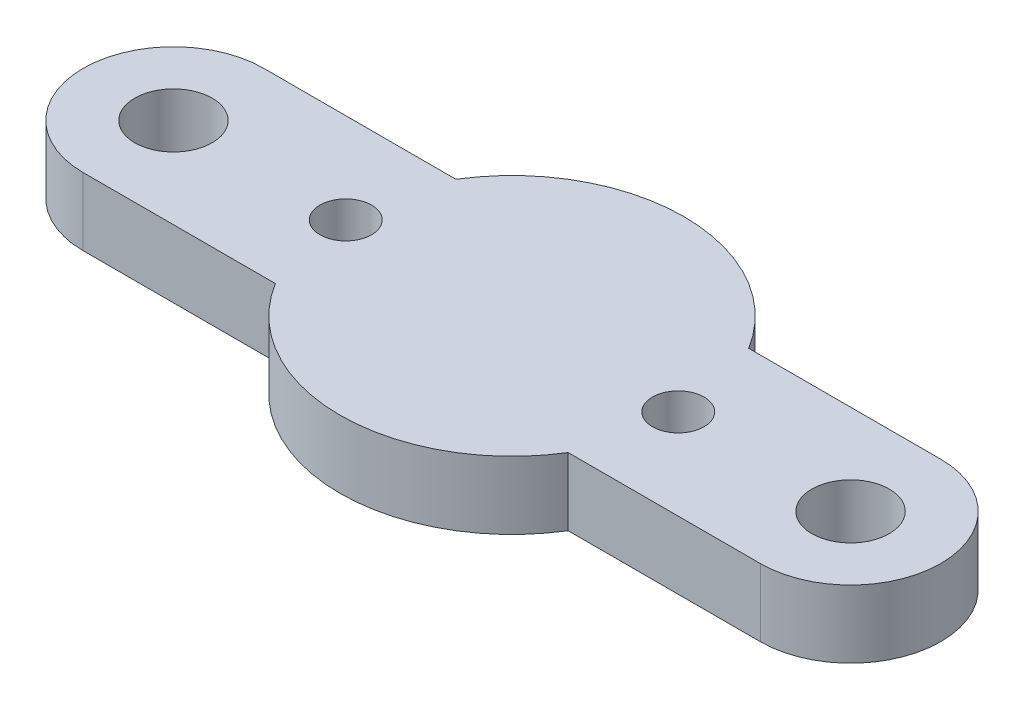
ISO-10303-21;
HEADER;
FILE_DESCRIPTION(('STEP AP214'),'2;1');
FILE_NAME('part.step','',(''),(''),'','','');
FILE_SCHEMA(('AUTOMOTIVE_DESIGN { 1 0 10303 214 1 1 1 1 }'));
ENDSEC;
DATA;
#1=APPLICATION_CONTEXT('core data for automotive mechanical design processes');
#2=APPLICATION_PROTOCOL_DEFINITION('international standard','automotive_design',2000,#1);
#3=PRODUCT_CONTEXT('',#1,'mechanical');
#4=PRODUCT('Part','Part','',(#3));
#5=PRODUCT_RELATED_PRODUCT_CATEGORY('part','',(#4));
#6=PRODUCT_DEFINITION_FORMATION('','',#4);
#7=PRODUCT_DEFINITION_CONTEXT('part definition',#1,'design');
#8=PRODUCT_DEFINITION('design','',#6,#7);
#9=PRODUCT_DEFINITION_SHAPE('','',#8);
#10=(LENGTH_UNIT() NAMED_UNIT(*) SI_UNIT(.MILLI.,.METRE.));
#11=(NAMED_UNIT(*) PLANE_ANGLE_UNIT() SI_UNIT($,.RADIAN.));
#12=(NAMED_UNIT(*) SI_UNIT($,.STERADIAN.) SOLID_ANGLE_UNIT());
#13=UNCERTAINTY_MEASURE_WITH_UNIT(LENGTH_MEASURE(1.E-05),#10,'distance_accuracy_value','');
#14=(GEOMETRIC_REPRESENTATION_CONTEXT(3) GLOBAL_UNCERTAINTY_ASSIGNED_CONTEXT((#13)) GLOBAL_UNIT_ASSIGNED_CONTEXT((#10,
#11,#12)) REPRESENTATION_CONTEXT('',''));
#15=CARTESIAN_POINT('',(0.,0.,0.));
#16=DIRECTION('',(0.,0.,1.));
#17=DIRECTION('',(1.,0.,0.));
#18=AXIS2_PLACEMENT_3D('',#15,#16,#17);
#19=CARTESIAN_POINT('',(-15.,3.,0.));
#20=DIRECTION('',(0.,1.,0.));
#21=DIRECTION('',(0.,0.,1.));
#22=AXIS2_PLACEMENT_3D('',#19,#20,#21);
#23=PLANE('',#22);
#24=CARTESIAN_POINT('',(-15.,3.,0.));
#25=DIRECTION('',(0.,1.,0.));
#26=DIRECTION('',(0.,0.,1.));
#27=AXIS2_PLACEMENT_3D('',#24,#25,#26);
#28=CIRCLE('',#27,1.7145);
#29=CARTESIAN_POINT('',(-15.,3.,1.7145));
#30=VERTEX_POINT('',#29);
#31=EDGE_CURVE('E190',#30,#30,#28,.T.);
#32=ORIENTED_EDGE('',*,*,#31,.F.);
#33=EDGE_LOOP('',(#32));
#34=FACE_BOUND('',#33,.T.);
#35=CARTESIAN_POINT('',(-7.366,3.,0.));
#36=DIRECTION('',(0.,1.,0.));
#37=DIRECTION('',(0.,0.,1.));
#38=AXIS2_PLACEMENT_3D('',#35,#36,#37);
#39=CIRCLE('',#38,1.143);
#40=CARTESIAN_POINT('',(-7.366,3.,1.143));
#41=VERTEX_POINT('',#40);
#42=EDGE_CURVE('E136',#41,#41,#39,.T.);
#43=ORIENTED_EDGE('',*,*,#42,.F.);
#44=EDGE_LOOP('',(#43));
#45=FACE_BOUND('',#44,.T.);
#46=CARTESIAN_POINT('',(-15.,3.,0.));
#47=DIRECTION('',(0.,1.,0.));
#48=DIRECTION('',(0.,0.,1.));
#49=AXIS2_PLACEMENT_3D('',#46,#47,#48);
#50=CIRCLE('',#49,3.99999999999999);
#51=CARTESIAN_POINT('',(-15.,3.,-3.99999999999999));
#52=VERTEX_POINT('',#51);
#53=CARTESIAN_POINT('',(-15.,3.,4.));
#54=VERTEX_POINT('',#53);
#55=EDGE_CURVE('E147',#52,#54,#50,.T.);
#56=ORIENTED_EDGE('',*,*,#55,.T.);
#57=DIRECTION('',(1.,0.,0.));
#58=VECTOR('',#57,1.);
#59=CARTESIAN_POINT('',(-15.,3.,4.));
#60=LINE('',#59,#58);
#61=CARTESIAN_POINT('',(-6.48570736311776,3.,4.));
#62=VERTEX_POINT('',#61);
#63=EDGE_CURVE('E95',#54,#62,#60,.T.);
#64=ORIENTED_EDGE('',*,*,#63,.T.);
#65=CARTESIAN_POINT('',(0.,3.,0.));
#66=DIRECTION('',(0.,1.,0.));
#67=DIRECTION('',(0.,0.,1.));
#68=AXIS2_PLACEMENT_3D('',#65,#66,#67);
#69=CIRCLE('',#68,7.62);
#70=CARTESIAN_POINT('',(6.48570736311776,3.,4.));
#71=VERTEX_POINT('',#70);
#72=EDGE_CURVE('E162',#62,#71,#69,.T.);
#73=ORIENTED_EDGE('',*,*,#72,.T.);
#74=DIRECTION('',(1.,0.,0.));
#75=VECTOR('',#74,1.);
#76=CARTESIAN_POINT('',(6.48570736311776,3.,4.));
#77=LINE('',#76,#75);
#78=CARTESIAN_POINT('',(15.,3.,3.99999999999999));
#79=VERTEX_POINT('',#78);
#80=EDGE_CURVE('E175',#71,#79,#77,.T.);
#81=ORIENTED_EDGE('',*,*,#80,.T.);
#82=CARTESIAN_POINT('',(15.,3.,0.));
#83=DIRECTION('',(0.,1.,0.));
#84=DIRECTION('',(0.,0.,1.));
#85=AXIS2_PLACEMENT_3D('',#82,#83,#84);
#86=CIRCLE('',#85,3.99999999999999);
#87=CARTESIAN_POINT('',(15.,3.,-3.99999999999999));
#88=VERTEX_POINT('',#87);
#89=EDGE_CURVE('E114',#79,#88,#86,.T.);
#90=ORIENTED_EDGE('',*,*,#89,.T.);
#91=DIRECTION('',(-1.,0.,0.));
#92=VECTOR('',#91,1.);
#93=CARTESIAN_POINT('',(6.48570736311776,3.,-4.));
#94=LINE('',#93,#92);
#95=CARTESIAN_POINT('',(6.48570736311776,3.,-4.));
#96=VERTEX_POINT('',#95);
#97=EDGE_CURVE('E108',#88,#96,#94,.T.);
#98=ORIENTED_EDGE('',*,*,#97,.T.);
#99=CARTESIAN_POINT('',(0.,3.,0.));
#100=DIRECTION('',(0.,1.,0.));
#101=DIRECTION('',(0.,0.,1.));
#102=AXIS2_PLACEMENT_3D('',#99,#100,#101);
#103=CIRCLE('',#102,7.62);
#104=CARTESIAN_POINT('',(-6.48570736311776,3.,-4.));
#105=VERTEX_POINT('',#104);
#106=EDGE_CURVE('E112',#96,#105,#103,.T.);
#107=ORIENTED_EDGE('',*,*,#106,.T.);
#108=DIRECTION('',(-1.,0.,0.));
#109=VECTOR('',#108,1.);
#110=CARTESIAN_POINT('',(-15.,3.,-3.99999999999999));
#111=LINE('',#110,#109);
#112=EDGE_CURVE('E52',#105,#52,#111,.T.);
#113=ORIENTED_EDGE('',*,*,#112,.T.);
#114=EDGE_LOOP('',(#56,#64,#73,#81,#90,#98,#107,#113));
#115=FACE_BOUND('',#114,.T.);
#116=CARTESIAN_POINT('',(7.366,3.,0.));
#117=DIRECTION('',(0.,1.,0.));
#118=DIRECTION('',(0.,0.,1.));
#119=AXIS2_PLACEMENT_3D('',#116,#117,#118);
#120=CIRCLE('',#119,1.143);
#121=CARTESIAN_POINT('',(7.366,3.,1.143));
#122=VERTEX_POINT('',#121);
#123=EDGE_CURVE('E184',#122,#122,#120,.T.);
#124=ORIENTED_EDGE('',*,*,#123,.F.);
#125=EDGE_LOOP('',(#124));
#126=FACE_BOUND('',#125,.T.);
#127=CARTESIAN_POINT('',(15.,3.,0.));
#128=DIRECTION('',(0.,1.,0.));
#129=DIRECTION('',(0.,0.,1.));
#130=AXIS2_PLACEMENT_3D('',#127,#128,#129);
#131=CIRCLE('',#130,1.7145);
#132=CARTESIAN_POINT('',(15.,3.,1.71449999999999));
#133=VERTEX_POINT('',#132);
#134=EDGE_CURVE('E196',#133,#133,#131,.T.);
#135=ORIENTED_EDGE('',*,*,#134,.F.);
#136=EDGE_LOOP('',(#135));
#137=FACE_BOUND('',#136,.T.);
#138=ADVANCED_FACE('F35',(#34,#45,#115,#126,#137),#23,.T.);
#139=CARTESIAN_POINT('',(-15.,0.,0.));
#140=DIRECTION('',(0.,1.,0.));
#141=DIRECTION('',(0.,0.,1.));
#142=AXIS2_PLACEMENT_3D('',#139,#140,#141);
#143=PLANE('',#142);
#144=CARTESIAN_POINT('',(-15.,0.,0.));
#145=DIRECTION('',(0.,1.,0.));
#146=DIRECTION('',(0.,0.,1.));
#147=AXIS2_PLACEMENT_3D('',#144,#145,#146);
#148=CIRCLE('',#147,1.7145);
#149=CARTESIAN_POINT('',(-15.,0.,1.7145));
#150=VERTEX_POINT('',#149);
#151=EDGE_CURVE('E193',#150,#150,#148,.T.);
#152=ORIENTED_EDGE('',*,*,#151,.T.);
#153=EDGE_LOOP('',(#152));
#154=FACE_BOUND('',#153,.T.);
#155=CARTESIAN_POINT('',(-7.366,0.,0.));
#156=DIRECTION('',(0.,1.,0.));
#157=DIRECTION('',(0.,0.,1.));
#158=AXIS2_PLACEMENT_3D('',#155,#156,#157);
#159=CIRCLE('',#158,1.143);
#160=CARTESIAN_POINT('',(-7.366,0.,1.143));
#161=VERTEX_POINT('',#160);
#162=EDGE_CURVE('E181',#161,#161,#159,.T.);
#163=ORIENTED_EDGE('',*,*,#162,.T.);
#164=EDGE_LOOP('',(#163));
#165=FACE_BOUND('',#164,.T.);
#166=CARTESIAN_POINT('',(-15.,0.,0.));
#167=DIRECTION('',(0.,1.,0.));
#168=DIRECTION('',(0.,0.,1.));
#169=AXIS2_PLACEMENT_3D('',#166,#167,#168);
#170=CIRCLE('',#169,3.99999999999999);
#171=CARTESIAN_POINT('',(-15.,0.,-3.99999999999999));
#172=VERTEX_POINT('',#171);
#173=CARTESIAN_POINT('',(-15.,0.,4.));
#174=VERTEX_POINT('',#173);
#175=EDGE_CURVE('E132',#172,#174,#170,.T.);
#176=ORIENTED_EDGE('',*,*,#175,.F.);
#177=DIRECTION('',(-1.,0.,0.));
#178=VECTOR('',#177,1.);
#179=CARTESIAN_POINT('',(-15.,0.,-3.99999999999999));
#180=LINE('',#179,#178);
#181=CARTESIAN_POINT('',(-6.48570736311776,0.,-4.));
#182=VERTEX_POINT('',#181);
#183=EDGE_CURVE('E87',#182,#172,#180,.T.);
#184=ORIENTED_EDGE('',*,*,#183,.F.);
#185=CARTESIAN_POINT('',(0.,0.,0.));
#186=DIRECTION('',(0.,1.,0.));
#187=DIRECTION('',(0.,0.,1.));
#188=AXIS2_PLACEMENT_3D('',#185,#186,#187);
#189=CIRCLE('',#188,7.62);
#190=CARTESIAN_POINT('',(6.48570736311776,0.,-4.));
#191=VERTEX_POINT('',#190);
#192=EDGE_CURVE('E81',#191,#182,#189,.T.);
#193=ORIENTED_EDGE('',*,*,#192,.F.);
#194=DIRECTION('',(-1.,0.,0.));
#195=VECTOR('',#194,1.);
#196=CARTESIAN_POINT('',(6.48570736311776,0.,-4.));
#197=LINE('',#196,#195);
#198=CARTESIAN_POINT('',(15.,0.,-3.99999999999999));
#199=VERTEX_POINT('',#198);
#200=EDGE_CURVE('E122',#199,#191,#197,.T.);
#201=ORIENTED_EDGE('',*,*,#200,.F.);
#202=CARTESIAN_POINT('',(15.,0.,0.));
#203=DIRECTION('',(0.,1.,0.));
#204=DIRECTION('',(0.,0.,1.));
#205=AXIS2_PLACEMENT_3D('',#202,#203,#204);
#206=CIRCLE('',#205,3.99999999999999);
#207=CARTESIAN_POINT('',(15.,0.,3.99999999999999));
#208=VERTEX_POINT('',#207);
#209=EDGE_CURVE('E142',#208,#199,#206,.T.);
#210=ORIENTED_EDGE('',*,*,#209,.F.);
#211=DIRECTION('',(1.,0.,0.));
#212=VECTOR('',#211,1.);
#213=CARTESIAN_POINT('',(6.48570736311776,0.,4.));
#214=LINE('',#213,#212);
#215=CARTESIAN_POINT('',(6.48570736311776,0.,4.));
#216=VERTEX_POINT('',#215);
#217=EDGE_CURVE('E140',#216,#208,#214,.T.);
#218=ORIENTED_EDGE('',*,*,#217,.F.);
#219=CARTESIAN_POINT('',(0.,0.,0.));
#220=DIRECTION('',(0.,1.,0.));
#221=DIRECTION('',(0.,0.,1.));
#222=AXIS2_PLACEMENT_3D('',#219,#220,#221);
#223=CIRCLE('',#222,7.62);
#224=CARTESIAN_POINT('',(-6.48570736311776,0.,4.));
#225=VERTEX_POINT('',#224);
#226=EDGE_CURVE('E138',#225,#216,#223,.T.);
#227=ORIENTED_EDGE('',*,*,#226,.F.);
#228=DIRECTION('',(1.,0.,0.));
#229=VECTOR('',#228,1.);
#230=CARTESIAN_POINT('',(-15.,0.,4.));
#231=LINE('',#230,#229);
#232=EDGE_CURVE('E135',#174,#225,#231,.T.);
#233=ORIENTED_EDGE('',*,*,#232,.F.);
#234=EDGE_LOOP('',(#176,#184,#193,#201,#210,#218,#227,#233));
#235=FACE_BOUND('',#234,.T.);
#236=CARTESIAN_POINT('',(7.366,0.,0.));
#237=DIRECTION('',(0.,1.,0.));
#238=DIRECTION('',(0.,0.,1.));
#239=AXIS2_PLACEMENT_3D('',#236,#237,#238);
#240=CIRCLE('',#239,1.143);
#241=CARTESIAN_POINT('',(7.366,0.,1.143));
#242=VERTEX_POINT('',#241);
#243=EDGE_CURVE('E187',#242,#242,#240,.T.);
#244=ORIENTED_EDGE('',*,*,#243,.T.);
#245=EDGE_LOOP('',(#244));
#246=FACE_BOUND('',#245,.T.);
#247=CARTESIAN_POINT('',(15.,0.,0.));
#248=DIRECTION('',(0.,1.,0.));
#249=DIRECTION('',(0.,0.,1.));
#250=AXIS2_PLACEMENT_3D('',#247,#248,#249);
#251=CIRCLE('',#250,1.7145);
#252=CARTESIAN_POINT('',(15.,0.,1.71449999999999));
#253=VERTEX_POINT('',#252);
#254=EDGE_CURVE('E199',#253,#253,#251,.T.);
#255=ORIENTED_EDGE('',*,*,#254,.T.);
#256=EDGE_LOOP('',(#255));
#257=FACE_BOUND('',#256,.T.);
#258=ADVANCED_FACE('F166',(#154,#165,#235,#246,#257),#143,.F.);
#259=CARTESIAN_POINT('',(-15.,3.,0.));
#260=DIRECTION('',(0.,-1.,0.));
#261=DIRECTION('',(0.,0.,-1.));
#262=AXIS2_PLACEMENT_3D('',#259,#260,#261);
#263=CYLINDRICAL_SURFACE('',#262,3.99999999999999);
#264=ORIENTED_EDGE('',*,*,#175,.T.);
#265=DIRECTION('',(0.,-1.,0.));
#266=VECTOR('',#265,1.);
#267=CARTESIAN_POINT('',(-15.,3.,4.));
#268=LINE('',#267,#266);
#269=EDGE_CURVE('E11',#54,#174,#268,.T.);
#270=ORIENTED_EDGE('',*,*,#269,.F.);
#271=ORIENTED_EDGE('',*,*,#55,.F.);
#272=DIRECTION('',(0.,-1.,0.));
#273=VECTOR('',#272,1.);
#274=CARTESIAN_POINT('',(-15.,3.,-3.99999999999999));
#275=LINE('',#274,#273);
#276=EDGE_CURVE('E128',#52,#172,#275,.T.);
#277=ORIENTED_EDGE('',*,*,#276,.T.);
#278=EDGE_LOOP('',(#264,#270,#271,#277));
#279=FACE_BOUND('',#278,.T.);
#280=ADVANCED_FACE('F37',(#279),#263,.T.);
#281=CARTESIAN_POINT('',(-15.,3.,4.));
#282=DIRECTION('',(0.,0.,-1.));
#283=DIRECTION('',(-1.,0.,0.));
#284=AXIS2_PLACEMENT_3D('',#281,#282,#283);
#285=PLANE('',#284);
#286=ORIENTED_EDGE('',*,*,#232,.T.);
#287=DIRECTION('',(0.,-1.,0.));
#288=VECTOR('',#287,1.);
#289=CARTESIAN_POINT('',(-6.48570736311776,3.,4.));
#290=LINE('',#289,#288);
#291=EDGE_CURVE('E44',#62,#225,#290,.T.);
#292=ORIENTED_EDGE('',*,*,#291,.F.);
#293=ORIENTED_EDGE('',*,*,#63,.F.);
#294=ORIENTED_EDGE('',*,*,#269,.T.);
#295=EDGE_LOOP('',(#286,#292,#293,#294));
#296=FACE_BOUND('',#295,.T.);
#297=ADVANCED_FACE('F234',(#296),#285,.F.);
#298=CARTESIAN_POINT('',(0.,3.,0.));
#299=DIRECTION('',(0.,-1.,0.));
#300=DIRECTION('',(0.,0.,-1.));
#301=AXIS2_PLACEMENT_3D('',#298,#299,#300);
#302=CYLINDRICAL_SURFACE('',#301,7.62);
#303=ORIENTED_EDGE('',*,*,#226,.T.);
#304=DIRECTION('',(0.,-1.,0.));
#305=VECTOR('',#304,1.);
#306=CARTESIAN_POINT('',(6.48570736311776,3.,4.));
#307=LINE('',#306,#305);
#308=EDGE_CURVE('E154',#71,#216,#307,.T.);
#309=ORIENTED_EDGE('',*,*,#308,.F.);
#310=ORIENTED_EDGE('',*,*,#72,.F.);
#311=ORIENTED_EDGE('',*,*,#291,.T.);
#312=EDGE_LOOP('',(#303,#309,#310,#311));
#313=FACE_BOUND('',#312,.T.);
#314=ADVANCED_FACE('F160',(#313),#302,.T.);
#315=CARTESIAN_POINT('',(6.48570736311776,3.,4.));
#316=DIRECTION('',(0.,0.,-1.));
#317=DIRECTION('',(-1.,0.,0.));
#318=AXIS2_PLACEMENT_3D('',#315,#316,#317);
#319=PLANE('',#318);
#320=ORIENTED_EDGE('',*,*,#217,.T.);
#321=DIRECTION('',(0.,-1.,0.));
#322=VECTOR('',#321,1.);
#323=CARTESIAN_POINT('',(15.,3.,3.99999999999999));
#324=LINE('',#323,#322);
#325=EDGE_CURVE('E151',#79,#208,#324,.T.);
#326=ORIENTED_EDGE('',*,*,#325,.F.);
#327=ORIENTED_EDGE('',*,*,#80,.F.);
#328=ORIENTED_EDGE('',*,*,#308,.T.);
#329=EDGE_LOOP('',(#320,#326,#327,#328));
#330=FACE_BOUND('',#329,.T.);
#331=ADVANCED_FACE('F171',(#330),#319,.F.);
#332=CARTESIAN_POINT('',(15.,3.,0.));
#333=DIRECTION('',(0.,-1.,0.));
#334=DIRECTION('',(0.,0.,-1.));
#335=AXIS2_PLACEMENT_3D('',#332,#333,#334);
#336=CYLINDRICAL_SURFACE('',#335,3.99999999999999);
#337=ORIENTED_EDGE('',*,*,#209,.T.);
#338=DIRECTION('',(0.,-1.,0.));
#339=VECTOR('',#338,1.);
#340=CARTESIAN_POINT('',(15.,3.,-3.99999999999999));
#341=LINE('',#340,#339);
#342=EDGE_CURVE('E123',#88,#199,#341,.T.);
#343=ORIENTED_EDGE('',*,*,#342,.F.);
#344=ORIENTED_EDGE('',*,*,#89,.F.);
#345=ORIENTED_EDGE('',*,*,#325,.T.);
#346=EDGE_LOOP('',(#337,#343,#344,#345));
#347=FACE_BOUND('',#346,.T.);
#348=ADVANCED_FACE('F174',(#347),#336,.T.);
#349=CARTESIAN_POINT('',(6.48570736311776,3.,-4.));
#350=DIRECTION('',(0.,0.,1.));
#351=DIRECTION('',(1.,0.,0.));
#352=AXIS2_PLACEMENT_3D('',#349,#350,#351);
#353=PLANE('',#352);
#354=ORIENTED_EDGE('',*,*,#200,.T.);
#355=DIRECTION('',(0.,-1.,0.));
#356=VECTOR('',#355,1.);
#357=CARTESIAN_POINT('',(6.48570736311776,3.,-4.));
#358=LINE('',#357,#356);
#359=EDGE_CURVE('E119',#96,#191,#358,.T.);
#360=ORIENTED_EDGE('',*,*,#359,.F.);
#361=ORIENTED_EDGE('',*,*,#97,.F.);
#362=ORIENTED_EDGE('',*,*,#342,.T.);
#363=EDGE_LOOP('',(#354,#360,#361,#362));
#364=FACE_BOUND('',#363,.T.);
#365=ADVANCED_FACE('F120',(#364),#353,.F.);
#366=CARTESIAN_POINT('',(0.,3.,0.));
#367=DIRECTION('',(0.,-1.,0.));
#368=DIRECTION('',(0.,0.,-1.));
#369=AXIS2_PLACEMENT_3D('',#366,#367,#368);
#370=CYLINDRICAL_SURFACE('',#369,7.62);
#371=ORIENTED_EDGE('',*,*,#192,.T.);
#372=DIRECTION('',(0.,-1.,0.));
#373=VECTOR('',#372,1.);
#374=CARTESIAN_POINT('',(-6.48570736311776,3.,-4.));
#375=LINE('',#374,#373);
#376=EDGE_CURVE('E124',#105,#182,#375,.T.);
#377=ORIENTED_EDGE('',*,*,#376,.F.);
#378=ORIENTED_EDGE('',*,*,#106,.F.);
#379=ORIENTED_EDGE('',*,*,#359,.T.);
#380=EDGE_LOOP('',(#371,#377,#378,#379));
#381=FACE_BOUND('',#380,.T.);
#382=ADVANCED_FACE('F126',(#381),#370,.T.);
#383=CARTESIAN_POINT('',(-15.,3.,-3.99999999999999));
#384=DIRECTION('',(0.,0.,1.));
#385=DIRECTION('',(1.,0.,0.));
#386=AXIS2_PLACEMENT_3D('',#383,#384,#385);
#387=PLANE('',#386);
#388=ORIENTED_EDGE('',*,*,#183,.T.);
#389=ORIENTED_EDGE('',*,*,#276,.F.);
#390=ORIENTED_EDGE('',*,*,#112,.F.);
#391=ORIENTED_EDGE('',*,*,#376,.T.);
#392=EDGE_LOOP('',(#388,#389,#390,#391));
#393=FACE_BOUND('',#392,.T.);
#394=ADVANCED_FACE('F222',(#393),#387,.F.);
#395=CARTESIAN_POINT('',(-7.366,3.,0.));
#396=DIRECTION('',(0.,-1.,0.));
#397=DIRECTION('',(0.,0.,-1.));
#398=AXIS2_PLACEMENT_3D('',#395,#396,#397);
#399=CYLINDRICAL_SURFACE('',#398,1.143);
#400=ORIENTED_EDGE('',*,*,#42,.T.);
#401=EDGE_LOOP('',(#400));
#402=FACE_BOUND('',#401,.T.);
#403=ORIENTED_EDGE('',*,*,#162,.F.);
#404=EDGE_LOOP('',(#403));
#405=FACE_BOUND('',#404,.T.);
#406=ADVANCED_FACE('F219',(#402,#405),#399,.F.);
#407=CARTESIAN_POINT('',(7.366,3.,0.));
#408=DIRECTION('',(0.,-1.,0.));
#409=DIRECTION('',(0.,0.,-1.));
#410=AXIS2_PLACEMENT_3D('',#407,#408,#409);
#411=CYLINDRICAL_SURFACE('',#410,1.143);
#412=ORIENTED_EDGE('',*,*,#123,.T.);
#413=EDGE_LOOP('',(#412));
#414=FACE_BOUND('',#413,.T.);
#415=ORIENTED_EDGE('',*,*,#243,.F.);
#416=EDGE_LOOP('',(#415));
#417=FACE_BOUND('',#416,.T.);
#418=ADVANCED_FACE('F298',(#414,#417),#411,.F.);
#419=CARTESIAN_POINT('',(-15.,3.,0.));
#420=DIRECTION('',(0.,-1.,0.));
#421=DIRECTION('',(0.,0.,-1.));
#422=AXIS2_PLACEMENT_3D('',#419,#420,#421);
#423=CYLINDRICAL_SURFACE('',#422,1.7145);
#424=ORIENTED_EDGE('',*,*,#31,.T.);
#425=EDGE_LOOP('',(#424));
#426=FACE_BOUND('',#425,.T.);
#427=ORIENTED_EDGE('',*,*,#151,.F.);
#428=EDGE_LOOP('',(#427));
#429=FACE_BOUND('',#428,.T.);
#430=ADVANCED_FACE('F306',(#426,#429),#423,.F.);
#431=CARTESIAN_POINT('',(15.,3.,0.));
#432=DIRECTION('',(0.,-1.,0.));
#433=DIRECTION('',(0.,0.,-1.));
#434=AXIS2_PLACEMENT_3D('',#431,#432,#433);
#435=CYLINDRICAL_SURFACE('',#434,1.7145);
#436=ORIENTED_EDGE('',*,*,#134,.T.);
#437=EDGE_LOOP('',(#436));
#438=FACE_BOUND('',#437,.T.);
#439=ORIENTED_EDGE('',*,*,#254,.F.);
#440=EDGE_LOOP('',(#439));
#441=FACE_BOUND('',#440,.T.);
#442=ADVANCED_FACE('F205',(#438,#441),#435,.F.);
#443=CLOSED_SHELL('',(#138,#258,#280,#297,#314,#331,#348,#365,#382,#394,#406,#418,#430,#442));
#444=MANIFOLD_SOLID_BREP('B2',#443);
#445=ADVANCED_BREP_SHAPE_REPRESENTATION('',(#18,#444),#14);
#446=SHAPE_DEFINITION_REPRESENTATION(#9,#445);
ENDSEC;
END-ISO-10303-21;
